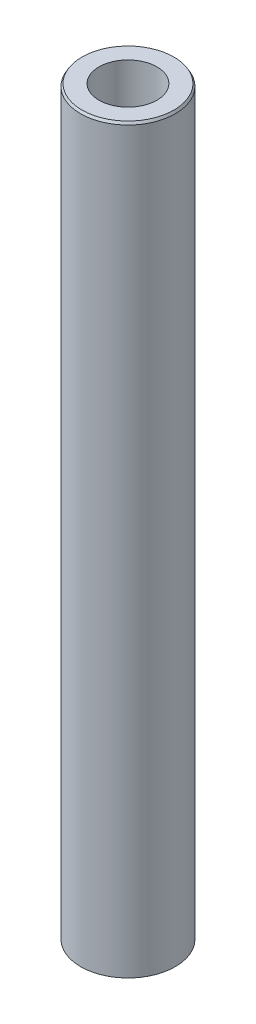
ISO-10303-21;
HEADER;
FILE_DESCRIPTION(('STEP AP214'),'2;1');
FILE_NAME('part.step','',(''),(''),'','','');
FILE_SCHEMA(('AUTOMOTIVE_DESIGN { 1 0 10303 214 1 1 1 1 }'));
ENDSEC;
DATA;
#1=APPLICATION_CONTEXT('core data for automotive mechanical design processes');
#2=APPLICATION_PROTOCOL_DEFINITION('international standard','automotive_design',2000,#1);
#3=PRODUCT_CONTEXT('',#1,'mechanical');
#4=PRODUCT('Part','Part','',(#3));
#5=PRODUCT_RELATED_PRODUCT_CATEGORY('part','',(#4));
#6=PRODUCT_DEFINITION_FORMATION('','',#4);
#7=PRODUCT_DEFINITION_CONTEXT('part definition',#1,'design');
#8=PRODUCT_DEFINITION('design','',#6,#7);
#9=PRODUCT_DEFINITION_SHAPE('','',#8);
#10=(LENGTH_UNIT() NAMED_UNIT(*) SI_UNIT(.MILLI.,.METRE.));
#11=(NAMED_UNIT(*) PLANE_ANGLE_UNIT() SI_UNIT($,.RADIAN.));
#12=(NAMED_UNIT(*) SI_UNIT($,.STERADIAN.) SOLID_ANGLE_UNIT());
#13=UNCERTAINTY_MEASURE_WITH_UNIT(LENGTH_MEASURE(1.E-05),#10,'distance_accuracy_value','');
#14=(GEOMETRIC_REPRESENTATION_CONTEXT(3) GLOBAL_UNCERTAINTY_ASSIGNED_CONTEXT((#13)) GLOBAL_UNIT_ASSIGNED_CONTEXT((#10,
#11,#12)) REPRESENTATION_CONTEXT('',''));
#15=CARTESIAN_POINT('',(0.,0.,0.));
#16=DIRECTION('',(0.,0.,1.));
#17=DIRECTION('',(1.,0.,0.));
#18=AXIS2_PLACEMENT_3D('',#15,#16,#17);
#19=CARTESIAN_POINT('',(0.,352.529486000883,0.));
#20=DIRECTION('',(0.,-1.,0.));
#21=DIRECTION('',(0.,0.,-1.));
#22=AXIS2_PLACEMENT_3D('',#19,#20,#21);
#23=CYLINDRICAL_SURFACE('',#22,22.5);
#24=CARTESIAN_POINT('',(0.,351.357812776782,0.));
#25=DIRECTION('',(0.,1.,0.));
#26=DIRECTION('',(0.,0.,1.));
#27=AXIS2_PLACEMENT_3D('',#24,#25,#26);
#28=CIRCLE('',#27,22.5);
#29=CARTESIAN_POINT('',(0.,351.357812776782,22.5));
#30=VERTEX_POINT('',#29);
#31=EDGE_CURVE('E50',#30,#30,#28,.F.);
#32=ORIENTED_EDGE('',*,*,#31,.T.);
#33=EDGE_LOOP('',(#32));
#34=FACE_BOUND('',#33,.T.);
#35=CARTESIAN_POINT('',(0.,0.676465851336738,0.));
#36=DIRECTION('',(0.,1.,0.));
#37=DIRECTION('',(0.,0.,1.));
#38=AXIS2_PLACEMENT_3D('',#35,#36,#37);
#39=CIRCLE('',#38,22.5);
#40=CARTESIAN_POINT('',(0.,0.676465851336738,22.5));
#41=VERTEX_POINT('',#40);
#42=EDGE_CURVE('E51',#41,#41,#39,.T.);
#43=ORIENTED_EDGE('',*,*,#42,.T.);
#44=EDGE_LOOP('',(#43));
#45=FACE_BOUND('',#44,.T.);
#46=ADVANCED_FACE('F39',(#34,#45),#23,.T.);
#47=CARTESIAN_POINT('',(0.,352.529486000883,0.));
#48=DIRECTION('',(0.,1.,0.));
#49=DIRECTION('',(0.,0.,1.));
#50=AXIS2_PLACEMENT_3D('',#47,#48,#49);
#51=PLANE('',#50);
#52=CARTESIAN_POINT('',(0.,352.529486000883,0.));
#53=DIRECTION('',(0.,1.,0.));
#54=DIRECTION('',(0.,0.,1.));
#55=AXIS2_PLACEMENT_3D('',#52,#53,#54);
#56=CIRCLE('',#55,21.8235341486631);
#57=CARTESIAN_POINT('',(0.,352.529486000883,21.8235341486631));
#58=VERTEX_POINT('',#57);
#59=EDGE_CURVE('E54',#58,#58,#56,.T.);
#60=ORIENTED_EDGE('',*,*,#59,.T.);
#61=EDGE_LOOP('',(#60));
#62=FACE_BOUND('',#61,.T.);
#63=CARTESIAN_POINT('',(0.,352.529486000883,0.));
#64=DIRECTION('',(0.,1.,0.));
#65=DIRECTION('',(0.,0.,1.));
#66=AXIS2_PLACEMENT_3D('',#63,#64,#65);
#67=CIRCLE('',#66,13.7466418711521);
#68=CARTESIAN_POINT('',(0.,352.529486000883,13.7466418711521));
#69=VERTEX_POINT('',#68);
#70=EDGE_CURVE('E58',#69,#69,#67,.T.);
#71=ORIENTED_EDGE('',*,*,#70,.F.);
#72=EDGE_LOOP('',(#71));
#73=FACE_BOUND('',#72,.T.);
#74=ADVANCED_FACE('F69',(#62,#73),#51,.T.);
#75=CARTESIAN_POINT('',(0.,0.,0.));
#76=DIRECTION('',(0.,1.,0.));
#77=DIRECTION('',(0.,0.,1.));
#78=AXIS2_PLACEMENT_3D('',#75,#76,#77);
#79=PLANE('',#78);
#80=CARTESIAN_POINT('',(0.,0.,0.));
#81=DIRECTION('',(0.,1.,0.));
#82=DIRECTION('',(0.,0.,1.));
#83=AXIS2_PLACEMENT_3D('',#80,#81,#82);
#84=CIRCLE('',#83,21.3283267758995);
#85=CARTESIAN_POINT('',(0.,0.,21.3283267758995));
#86=VERTEX_POINT('',#85);
#87=EDGE_CURVE('E10',#86,#86,#84,.F.);
#88=ORIENTED_EDGE('',*,*,#87,.T.);
#89=EDGE_LOOP('',(#88));
#90=FACE_BOUND('',#89,.T.);
#91=CARTESIAN_POINT('',(0.,0.,0.));
#92=DIRECTION('',(0.,1.,0.));
#93=DIRECTION('',(0.,0.,1.));
#94=AXIS2_PLACEMENT_3D('',#91,#92,#93);
#95=CIRCLE('',#94,13.7466418711521);
#96=CARTESIAN_POINT('',(0.,0.,13.7466418711521));
#97=VERTEX_POINT('',#96);
#98=EDGE_CURVE('E63',#97,#97,#95,.T.);
#99=ORIENTED_EDGE('',*,*,#98,.T.);
#100=EDGE_LOOP('',(#99));
#101=FACE_BOUND('',#100,.T.);
#102=ADVANCED_FACE('F75',(#90,#101),#79,.F.);
#103=CARTESIAN_POINT('',(0.,352.529486000883,0.));
#104=DIRECTION('',(0.,-1.,0.));
#105=DIRECTION('',(0.,0.,-1.));
#106=AXIS2_PLACEMENT_3D('',#103,#104,#105);
#107=CYLINDRICAL_SURFACE('',#106,13.7466418711521);
#108=ORIENTED_EDGE('',*,*,#70,.T.);
#109=EDGE_LOOP('',(#108));
#110=FACE_BOUND('',#109,.T.);
#111=ORIENTED_EDGE('',*,*,#98,.F.);
#112=EDGE_LOOP('',(#111));
#113=FACE_BOUND('',#112,.T.);
#114=ADVANCED_FACE('F70',(#110,#113),#107,.F.);
#115=CARTESIAN_POINT('',(0.,352.529486000883,0.));
#116=DIRECTION('',(0.,-1.,0.));
#117=DIRECTION('',(0.,0.,-1.));
#118=AXIS2_PLACEMENT_3D('',#115,#116,#117);
#119=CONICAL_SURFACE('',#118,21.8235341486631,0.523598775598298);
#120=ORIENTED_EDGE('',*,*,#31,.F.);
#121=EDGE_LOOP('',(#120));
#122=FACE_BOUND('',#121,.T.);
#123=ORIENTED_EDGE('',*,*,#59,.F.);
#124=EDGE_LOOP('',(#123));
#125=FACE_BOUND('',#124,.T.);
#126=ADVANCED_FACE('F81',(#122,#125),#119,.T.);
#127=CARTESIAN_POINT('',(0.,0.676465851336738,0.));
#128=DIRECTION('',(0.,1.,0.));
#129=DIRECTION('',(0.,0.,1.));
#130=AXIS2_PLACEMENT_3D('',#127,#128,#129);
#131=CONICAL_SURFACE('',#130,22.5,1.04719755119659);
#132=CARTESIAN_POINT('',(0.,0.,21.3283267758995));
#133=CARTESIAN_POINT('',(0.,0.0070465192847583,21.3405317053172));
#134=CARTESIAN_POINT('',(0.,0.0140930385695158,21.3527366347349));
#135=CARTESIAN_POINT('',(0.,0.0281860771390307,21.3771464935703));
#136=CARTESIAN_POINT('',(0.,0.0352325964237881,21.389351422988));
#137=CARTESIAN_POINT('',(0.,0.0493256349933034,21.4137612818235));
#138=CARTESIAN_POINT('',(0.,0.0563721542780613,21.4259662112412));
#139=CARTESIAN_POINT('',(0.,0.070465192847577,21.4503760700766));
#140=CARTESIAN_POINT('',(0.,0.0775117121323348,21.4625809994943));
#141=CARTESIAN_POINT('',(0.,0.09160475070185,21.4869908583297));
#142=CARTESIAN_POINT('',(0.,0.0986512699866074,21.4991957877475));
#143=CARTESIAN_POINT('',(0.,0.112744308556123,21.5236056465829));
#144=CARTESIAN_POINT('',(0.,0.11979082784088,21.5358105760006));
#145=CARTESIAN_POINT('',(0.,0.133883866410396,21.560220434836));
#146=CARTESIAN_POINT('',(0.,0.140930385695154,21.5724253642537));
#147=CARTESIAN_POINT('',(0.,0.155023424264669,21.5968352230892));
#148=CARTESIAN_POINT('',(0.,0.162069943549427,21.6090401525069));
#149=CARTESIAN_POINT('',(0.,0.176162982118942,21.6334500113423));
#150=CARTESIAN_POINT('',(0.,0.1832095014037,21.64565494076));
#151=CARTESIAN_POINT('',(0.,0.197302539973215,21.6700647995955));
#152=CARTESIAN_POINT('',(0.,0.204349059257973,21.6822697290132));
#153=CARTESIAN_POINT('',(0.,0.218442097827488,21.7066795878486));
#154=CARTESIAN_POINT('',(0.,0.225488617112246,21.7188845172663));
#155=CARTESIAN_POINT('',(0.,0.239581655681761,21.7432943761017));
#156=CARTESIAN_POINT('',(0.,0.246628174966519,21.7554993055195));
#157=CARTESIAN_POINT('',(0.,0.260721213536035,21.7799091643549));
#158=CARTESIAN_POINT('',(0.,0.267767732820793,21.7921140937726));
#159=CARTESIAN_POINT('',(0.,0.281860771390308,21.816523952608));
#160=CARTESIAN_POINT('',(0.,0.288907290675065,21.8287288820257));
#161=CARTESIAN_POINT('',(0.,0.30300032924458,21.8531387408612));
#162=CARTESIAN_POINT('',(0.,0.310046848529338,21.8653436702789));
#163=CARTESIAN_POINT('',(0.,0.324139887098854,21.8897535291143));
#164=CARTESIAN_POINT('',(0.,0.331186406383612,21.901958458532));
#165=CARTESIAN_POINT('',(0.,0.345279444953127,21.9263683173674));
#166=CARTESIAN_POINT('',(0.,0.352325964237884,21.9385732467852));
#167=CARTESIAN_POINT('',(0.,0.3664190028074,21.9629831056206));
#168=CARTESIAN_POINT('',(0.,0.373465522092157,21.9751880350383));
#169=CARTESIAN_POINT('',(0.,0.387558560661673,21.9995978938737));
#170=CARTESIAN_POINT('',(0.,0.394605079946431,22.0118028232914));
#171=CARTESIAN_POINT('',(0.,0.408698118515946,22.0362126821269));
#172=CARTESIAN_POINT('',(0.,0.415744637800703,22.0484176115446));
#173=CARTESIAN_POINT('',(0.,0.429837676370219,22.07282747038));
#174=CARTESIAN_POINT('',(0.,0.436884195654977,22.0850323997977));
#175=CARTESIAN_POINT('',(0.,0.450977234224492,22.1094422586332));
#176=CARTESIAN_POINT('',(0.,0.45802375350925,22.1216471880509));
#177=CARTESIAN_POINT('',(0.,0.472116792078765,22.1460570468863));
#178=CARTESIAN_POINT('',(0.,0.479163311363523,22.158261976304));
#179=CARTESIAN_POINT('',(0.,0.493256349933039,22.1826718351394));
#180=CARTESIAN_POINT('',(0.,0.500302869217796,22.1948767645572));
#181=CARTESIAN_POINT('',(0.,0.514395907787312,22.2192866233926));
#182=CARTESIAN_POINT('',(0.,0.521442427072069,22.2314915528103));
#183=CARTESIAN_POINT('',(0.,0.535535465641584,22.2559014116457));
#184=CARTESIAN_POINT('',(0.,0.542581984926342,22.2681063410634));
#185=CARTESIAN_POINT('',(0.,0.556675023495858,22.2925161998989));
#186=CARTESIAN_POINT('',(0.,0.563721542780616,22.3047211293166));
#187=CARTESIAN_POINT('',(0.,0.577814581350131,22.329130988152));
#188=CARTESIAN_POINT('',(0.,0.584861100634888,22.3413359175697));
#189=CARTESIAN_POINT('',(0.,0.598954139204403,22.3657457764052));
#190=CARTESIAN_POINT('',(0.,0.606000658489161,22.3779507058229));
#191=CARTESIAN_POINT('',(0.,0.620093697058677,22.4023605646583));
#192=CARTESIAN_POINT('',(0.,0.627140216343435,22.414565494076));
#193=CARTESIAN_POINT('',(0.,0.64123325491295,22.4389753529114));
#194=CARTESIAN_POINT('',(0.,0.648279774197708,22.4511802823291));
#195=CARTESIAN_POINT('',(0.,0.662372812767222,22.4755901411646));
#196=CARTESIAN_POINT('',(0.,0.66941933205198,22.4877950705823));
#197=CARTESIAN_POINT('',(0.,0.676465851336738,22.5));
#198=B_SPLINE_CURVE_WITH_KNOTS('',3,(#132,#133,#134,#135,#136,#137,#138,#139,#140,#141,#142,
#143,#144,#145,#146,#147,#148,#149,#150,#151,#152,#153,#154,#155,#156,#157,#158,#159,#160,#161,
#162,#163,#164,#165,#166,#167,#168,#169,#170,#171,#172,#173,#174,#175,#176,#177,#178,#179,#180,
#181,#182,#183,#184,#185,#186,#187,#188,#189,#190,#191,#192,#193,#194,#195,#196,#197),
.UNSPECIFIED.,.F.,.F.,(4,2,2,2,2,2,2,2,2,2,2,2,2,2,2,2,2,2,2,2,2,2,2,2,2,2,2,2,2,2,2,2,4),(0.,
0.0422791157085444,0.0845582314170917,0.126837347125636,0.16911646283418,0.211395578542728,
0.253674694251272,0.295953809959817,0.338232925668364,0.380512041376908,0.422791157085453,
0.465070272794,0.507349388502544,0.549628504211089,0.591907619919636,0.634186735628181,
0.676465851336725,0.718744967045272,0.761024082753817,0.803303198462361,0.845582314170908,
0.887861429879453,0.930140545588,0.972419661296545,1.01469877700509,1.05697789271364,
1.09925700842218,1.14153612413073,1.18381523983927,1.22609435554782,1.26837347125636,
1.31065258696491,1.35293170267345),.UNSPECIFIED.);
#199=EDGE_CURVE('BSEAM45',#86,#41,#198,.T.);
#200=ORIENTED_EDGE('',*,*,#87,.F.);
#201=ORIENTED_EDGE('',*,*,#42,.F.);
#202=ORIENTED_EDGE('',*,*,#199,.T.);
#203=ORIENTED_EDGE('',*,*,#199,.F.);
#204=EDGE_LOOP('',(#200,#202,#201,#203));
#205=FACE_BOUND('',#204,.T.);
#206=ADVANCED_FACE('F45',(#205),#131,.T.);
#207=CLOSED_SHELL('',(#46,#74,#102,#114,#126,#206));
#208=MANIFOLD_SOLID_BREP('B2',#207);
#209=ADVANCED_BREP_SHAPE_REPRESENTATION('',(#18,#208),#14);
#210=SHAPE_DEFINITION_REPRESENTATION(#9,#209);
ENDSEC;
END-ISO-10303-21;
